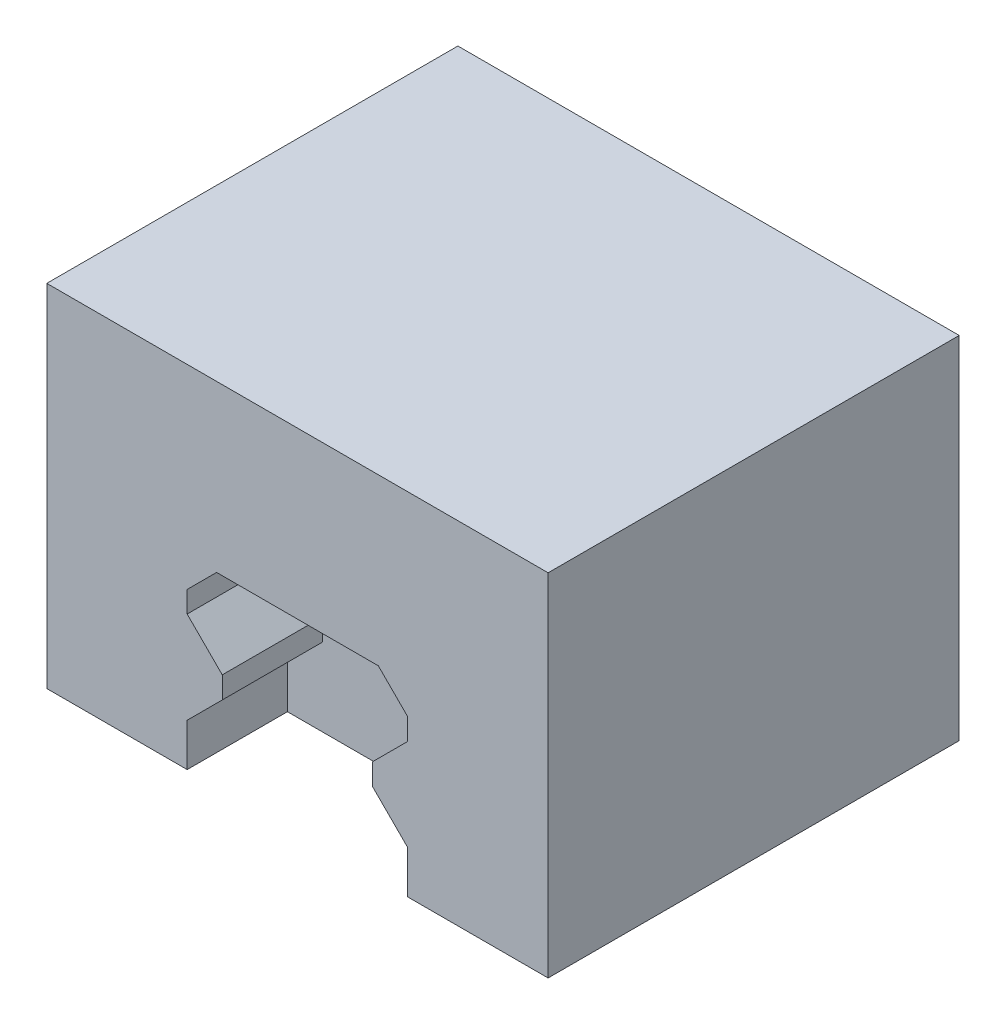
ISO-10303-21;
HEADER;
FILE_DESCRIPTION(('STEP AP214'),'2;1');
FILE_NAME('part.step','',(''),(''),'','','');
FILE_SCHEMA(('AUTOMOTIVE_DESIGN { 1 0 10303 214 1 1 1 1 }'));
ENDSEC;
DATA;
#1=APPLICATION_CONTEXT('core data for automotive mechanical design processes');
#2=APPLICATION_PROTOCOL_DEFINITION('international standard','automotive_design',2000,#1);
#3=PRODUCT_CONTEXT('',#1,'mechanical');
#4=PRODUCT('Part','Part','',(#3));
#5=PRODUCT_RELATED_PRODUCT_CATEGORY('part','',(#4));
#6=PRODUCT_DEFINITION_FORMATION('','',#4);
#7=PRODUCT_DEFINITION_CONTEXT('part definition',#1,'design');
#8=PRODUCT_DEFINITION('design','',#6,#7);
#9=PRODUCT_DEFINITION_SHAPE('','',#8);
#10=(LENGTH_UNIT() NAMED_UNIT(*) SI_UNIT(.MILLI.,.METRE.));
#11=(NAMED_UNIT(*) PLANE_ANGLE_UNIT() SI_UNIT($,.RADIAN.));
#12=(NAMED_UNIT(*) SI_UNIT($,.STERADIAN.) SOLID_ANGLE_UNIT());
#13=UNCERTAINTY_MEASURE_WITH_UNIT(LENGTH_MEASURE(1.E-05),#10,'distance_accuracy_value','');
#14=(GEOMETRIC_REPRESENTATION_CONTEXT(3) GLOBAL_UNCERTAINTY_ASSIGNED_CONTEXT((#13)) GLOBAL_UNIT_ASSIGNED_CONTEXT((#10,
#11,#12)) REPRESENTATION_CONTEXT('',''));
#15=CARTESIAN_POINT('',(0.,0.,0.));
#16=DIRECTION('',(0.,0.,1.));
#17=DIRECTION('',(1.,0.,0.));
#18=AXIS2_PLACEMENT_3D('',#15,#16,#17);
#19=CARTESIAN_POINT('',(-25.,-14.5,-31.));
#20=DIRECTION('',(0.,-1.,0.));
#21=DIRECTION('',(1.,0.,0.));
#22=AXIS2_PLACEMENT_3D('',#19,#20,#21);
#23=PLANE('',#22);
#24=DIRECTION('',(0.,0.,-1.));
#25=VECTOR('',#24,1.);
#26=CARTESIAN_POINT('',(-11.,-14.5,-31.));
#27=LINE('',#26,#25);
#28=CARTESIAN_POINT('',(-11.,-14.5,10.));
#29=VERTEX_POINT('',#28);
#30=CARTESIAN_POINT('',(-11.,-14.5,0.));
#31=VERTEX_POINT('',#30);
#32=EDGE_CURVE('E285',#29,#31,#27,.T.);
#33=ORIENTED_EDGE('',*,*,#32,.F.);
#34=DIRECTION('',(1.,0.,0.));
#35=VECTOR('',#34,1.);
#36=CARTESIAN_POINT('',(-25.,-14.5,10.));
#37=LINE('',#36,#35);
#38=CARTESIAN_POINT('',(-25.,-14.5,10.));
#39=VERTEX_POINT('',#38);
#40=EDGE_CURVE('E330',#39,#29,#37,.T.);
#41=ORIENTED_EDGE('',*,*,#40,.F.);
#42=DIRECTION('',(0.,0.,1.));
#43=VECTOR('',#42,1.);
#44=CARTESIAN_POINT('',(-25.,-14.5,-31.));
#45=LINE('',#44,#43);
#46=CARTESIAN_POINT('',(-25.,-14.5,-31.));
#47=VERTEX_POINT('',#46);
#48=EDGE_CURVE('E47',#47,#39,#45,.T.);
#49=ORIENTED_EDGE('',*,*,#48,.F.);
#50=DIRECTION('',(1.,0.,0.));
#51=VECTOR('',#50,1.);
#52=CARTESIAN_POINT('',(-25.,-14.5,-31.));
#53=LINE('',#52,#51);
#54=CARTESIAN_POINT('',(25.,-14.5,-31.));
#55=VERTEX_POINT('',#54);
#56=EDGE_CURVE('E345',#47,#55,#53,.T.);
#57=ORIENTED_EDGE('',*,*,#56,.T.);
#58=DIRECTION('',(0.,0.,1.));
#59=VECTOR('',#58,1.);
#60=CARTESIAN_POINT('',(25.,-14.5,-31.));
#61=LINE('',#60,#59);
#62=CARTESIAN_POINT('',(25.,-14.5,10.));
#63=VERTEX_POINT('',#62);
#64=EDGE_CURVE('E356',#55,#63,#61,.T.);
#65=ORIENTED_EDGE('',*,*,#64,.T.);
#66=CARTESIAN_POINT('',(11.,-14.5,10.));
#67=VERTEX_POINT('',#66);
#68=EDGE_CURVE('E329',#67,#63,#37,.T.);
#69=ORIENTED_EDGE('',*,*,#68,.F.);
#70=DIRECTION('',(0.,0.,1.));
#71=VECTOR('',#70,1.);
#72=CARTESIAN_POINT('',(11.,-14.5,-31.));
#73=LINE('',#72,#71);
#74=CARTESIAN_POINT('',(11.,-14.5,0.));
#75=VERTEX_POINT('',#74);
#76=EDGE_CURVE('E319',#75,#67,#73,.T.);
#77=ORIENTED_EDGE('',*,*,#76,.F.);
#78=DIRECTION('',(1.,0.,0.));
#79=VECTOR('',#78,1.);
#80=CARTESIAN_POINT('',(-10.,-14.5,0.));
#81=LINE('',#80,#79);
#82=EDGE_CURVE('E322',#31,#75,#81,.T.);
#83=ORIENTED_EDGE('',*,*,#82,.F.);
#84=EDGE_LOOP('',(#33,#41,#49,#57,#65,#69,#77,#83));
#85=FACE_BOUND('',#84,.T.);
#86=ADVANCED_FACE('F43',(#85),#23,.T.);
#87=CARTESIAN_POINT('',(0.,0.,10.));
#88=DIRECTION('',(0.,0.,1.));
#89=DIRECTION('',(1.,0.,0.));
#90=AXIS2_PLACEMENT_3D('',#87,#88,#89);
#91=PLANE('',#90);
#92=DIRECTION('',(0.,1.,0.));
#93=VECTOR('',#92,1.);
#94=CARTESIAN_POINT('',(11.,-15.5,10.));
#95=LINE('',#94,#93);
#96=CARTESIAN_POINT('',(11.,-10.2357864376269,10.));
#97=VERTEX_POINT('',#96);
#98=EDGE_CURVE('E248',#67,#97,#95,.T.);
#99=ORIENTED_EDGE('',*,*,#98,.F.);
#100=ORIENTED_EDGE('',*,*,#68,.T.);
#101=DIRECTION('',(0.,1.,0.));
#102=VECTOR('',#101,1.);
#103=CARTESIAN_POINT('',(25.,20.5,10.));
#104=LINE('',#103,#102);
#105=CARTESIAN_POINT('',(25.,20.5,10.));
#106=VERTEX_POINT('',#105);
#107=EDGE_CURVE('E334',#63,#106,#104,.T.);
#108=ORIENTED_EDGE('',*,*,#107,.T.);
#109=DIRECTION('',(-1.,0.,0.));
#110=VECTOR('',#109,1.);
#111=CARTESIAN_POINT('',(-25.,20.5,10.));
#112=LINE('',#111,#110);
#113=CARTESIAN_POINT('',(-25.,20.5,10.));
#114=VERTEX_POINT('',#113);
#115=EDGE_CURVE('E338',#106,#114,#112,.T.);
#116=ORIENTED_EDGE('',*,*,#115,.T.);
#117=DIRECTION('',(0.,-1.,0.));
#118=VECTOR('',#117,1.);
#119=CARTESIAN_POINT('',(-25.,20.5,10.));
#120=LINE('',#119,#118);
#121=EDGE_CURVE('E325',#114,#39,#120,.T.);
#122=ORIENTED_EDGE('',*,*,#121,.T.);
#123=ORIENTED_EDGE('',*,*,#40,.T.);
#124=DIRECTION('',(0.,-1.,0.));
#125=VECTOR('',#124,1.);
#126=CARTESIAN_POINT('',(-11.,-10.2357864376269,10.));
#127=LINE('',#126,#125);
#128=CARTESIAN_POINT('',(-11.,-10.2357864376269,10.));
#129=VERTEX_POINT('',#128);
#130=EDGE_CURVE('E245',#129,#29,#127,.T.);
#131=ORIENTED_EDGE('',*,*,#130,.F.);
#132=DIRECTION('',(-0.707106781186548,-0.707106781186547,0.));
#133=VECTOR('',#132,1.);
#134=CARTESIAN_POINT('',(-7.5,-6.7357864376269,10.));
#135=LINE('',#134,#133);
#136=CARTESIAN_POINT('',(-7.5,-6.7357864376269,10.));
#137=VERTEX_POINT('',#136);
#138=EDGE_CURVE('E241',#137,#129,#135,.T.);
#139=ORIENTED_EDGE('',*,*,#138,.F.);
#140=DIRECTION('',(0.,-1.,0.));
#141=VECTOR('',#140,1.);
#142=CARTESIAN_POINT('',(-7.5,-4.5642135623731,10.));
#143=LINE('',#142,#141);
#144=CARTESIAN_POINT('',(-7.5,-4.5642135623731,10.));
#145=VERTEX_POINT('',#144);
#146=EDGE_CURVE('E238',#145,#137,#143,.T.);
#147=ORIENTED_EDGE('',*,*,#146,.F.);
#148=DIRECTION('',(0.707106781186549,-0.707106781186546,0.));
#149=VECTOR('',#148,1.);
#150=CARTESIAN_POINT('',(-9.972086609225,-2.0921269531481,10.));
#151=LINE('',#150,#149);
#152=CARTESIAN_POINT('',(-11.,-1.06421356237309,10.));
#153=VERTEX_POINT('',#152);
#154=EDGE_CURVE('E176',#153,#145,#151,.T.);
#155=ORIENTED_EDGE('',*,*,#154,.F.);
#156=DIRECTION('',(0.,-1.,0.));
#157=VECTOR('',#156,1.);
#158=CARTESIAN_POINT('',(-11.,1.06421356237309,10.));
#159=LINE('',#158,#157);
#160=CARTESIAN_POINT('',(-11.,1.06421356237309,10.));
#161=VERTEX_POINT('',#160);
#162=EDGE_CURVE('E200',#161,#153,#159,.T.);
#163=ORIENTED_EDGE('',*,*,#162,.F.);
#164=DIRECTION('',(-0.707106781186545,-0.70710678118655,0.));
#165=VECTOR('',#164,1.);
#166=CARTESIAN_POINT('',(-9.972086609225,2.0921269531481,10.));
#167=LINE('',#166,#165);
#168=CARTESIAN_POINT('',(-8.06421356237309,4.,10.));
#169=VERTEX_POINT('',#168);
#170=EDGE_CURVE('E275',#169,#161,#167,.T.);
#171=ORIENTED_EDGE('',*,*,#170,.F.);
#172=DIRECTION('',(-1.,0.,0.));
#173=VECTOR('',#172,1.);
#174=CARTESIAN_POINT('',(8.06421356237309,4.,10.));
#175=LINE('',#174,#173);
#176=CARTESIAN_POINT('',(8.06421356237309,4.,10.));
#177=VERTEX_POINT('',#176);
#178=EDGE_CURVE('E271',#177,#169,#175,.T.);
#179=ORIENTED_EDGE('',*,*,#178,.F.);
#180=DIRECTION('',(-0.707106781186547,0.707106781186547,0.));
#181=VECTOR('',#180,1.);
#182=CARTESIAN_POINT('',(9.0921269531481,2.972086609225,10.));
#183=LINE('',#182,#181);
#184=CARTESIAN_POINT('',(11.,1.0642135623731,10.));
#185=VERTEX_POINT('',#184);
#186=EDGE_CURVE('E267',#185,#177,#183,.T.);
#187=ORIENTED_EDGE('',*,*,#186,.F.);
#188=DIRECTION('',(0.,1.,0.));
#189=VECTOR('',#188,1.);
#190=CARTESIAN_POINT('',(11.,-1.06421356237309,10.));
#191=LINE('',#190,#189);
#192=CARTESIAN_POINT('',(11.,-1.06421356237309,10.));
#193=VERTEX_POINT('',#192);
#194=EDGE_CURVE('E263',#193,#185,#191,.T.);
#195=ORIENTED_EDGE('',*,*,#194,.F.);
#196=DIRECTION('',(0.707106781186545,0.70710678118655,0.));
#197=VECTOR('',#196,1.);
#198=CARTESIAN_POINT('',(9.972086609225,-2.0921269531481,10.));
#199=LINE('',#198,#197);
#200=CARTESIAN_POINT('',(7.5,-4.56421356237309,10.));
#201=VERTEX_POINT('',#200);
#202=EDGE_CURVE('E259',#201,#193,#199,.T.);
#203=ORIENTED_EDGE('',*,*,#202,.F.);
#204=DIRECTION('',(0.,1.,0.));
#205=VECTOR('',#204,1.);
#206=CARTESIAN_POINT('',(7.5,-6.7357864376269,10.));
#207=LINE('',#206,#205);
#208=CARTESIAN_POINT('',(7.5,-6.7357864376269,10.));
#209=VERTEX_POINT('',#208);
#210=EDGE_CURVE('E255',#209,#201,#207,.T.);
#211=ORIENTED_EDGE('',*,*,#210,.F.);
#212=DIRECTION('',(-0.707106781186549,0.707106781186546,0.));
#213=VECTOR('',#212,1.);
#214=CARTESIAN_POINT('',(11.,-10.2357864376269,10.));
#215=LINE('',#214,#213);
#216=EDGE_CURVE('E251',#97,#209,#215,.T.);
#217=ORIENTED_EDGE('',*,*,#216,.F.);
#218=EDGE_LOOP('',(#99,#100,#108,#116,#122,#123,#131,#139,#147,#155,#163,#171,#179,#187,#195,
#203,#211,#217));
#219=FACE_BOUND('',#218,.T.);
#220=ADVANCED_FACE('F369',(#219),#91,.T.);
#221=CARTESIAN_POINT('',(-25.,20.5,-31.));
#222=DIRECTION('',(-1.,0.,0.));
#223=DIRECTION('',(0.,-1.,0.));
#224=AXIS2_PLACEMENT_3D('',#221,#222,#223);
#225=PLANE('',#224);
#226=ORIENTED_EDGE('',*,*,#48,.T.);
#227=ORIENTED_EDGE('',*,*,#121,.F.);
#228=DIRECTION('',(0.,0.,1.));
#229=VECTOR('',#228,1.);
#230=CARTESIAN_POINT('',(-25.,20.5,-31.));
#231=LINE('',#230,#229);
#232=CARTESIAN_POINT('',(-25.,20.5,-31.));
#233=VERTEX_POINT('',#232);
#234=EDGE_CURVE('E11',#233,#114,#231,.T.);
#235=ORIENTED_EDGE('',*,*,#234,.F.);
#236=DIRECTION('',(0.,-1.,0.));
#237=VECTOR('',#236,1.);
#238=CARTESIAN_POINT('',(-25.,20.5,-31.));
#239=LINE('',#238,#237);
#240=EDGE_CURVE('E342',#233,#47,#239,.T.);
#241=ORIENTED_EDGE('',*,*,#240,.T.);
#242=EDGE_LOOP('',(#226,#227,#235,#241));
#243=FACE_BOUND('',#242,.T.);
#244=ADVANCED_FACE('F45',(#243),#225,.T.);
#245=CARTESIAN_POINT('',(-25.,20.5,-31.));
#246=DIRECTION('',(0.,1.,0.));
#247=DIRECTION('',(-1.,0.,0.));
#248=AXIS2_PLACEMENT_3D('',#245,#246,#247);
#249=PLANE('',#248);
#250=ORIENTED_EDGE('',*,*,#234,.T.);
#251=ORIENTED_EDGE('',*,*,#115,.F.);
#252=DIRECTION('',(0.,0.,1.));
#253=VECTOR('',#252,1.);
#254=CARTESIAN_POINT('',(25.,20.5,-31.));
#255=LINE('',#254,#253);
#256=CARTESIAN_POINT('',(25.,20.5,-31.));
#257=VERTEX_POINT('',#256);
#258=EDGE_CURVE('E53',#257,#106,#255,.T.);
#259=ORIENTED_EDGE('',*,*,#258,.F.);
#260=DIRECTION('',(-1.,0.,0.));
#261=VECTOR('',#260,1.);
#262=CARTESIAN_POINT('',(-25.,20.5,-31.));
#263=LINE('',#262,#261);
#264=EDGE_CURVE('E352',#257,#233,#263,.T.);
#265=ORIENTED_EDGE('',*,*,#264,.T.);
#266=EDGE_LOOP('',(#250,#251,#259,#265));
#267=FACE_BOUND('',#266,.T.);
#268=ADVANCED_FACE('F370',(#267),#249,.T.);
#269=CARTESIAN_POINT('',(25.,20.5,-31.));
#270=DIRECTION('',(1.,0.,0.));
#271=DIRECTION('',(0.,1.,0.));
#272=AXIS2_PLACEMENT_3D('',#269,#270,#271);
#273=PLANE('',#272);
#274=ORIENTED_EDGE('',*,*,#258,.T.);
#275=ORIENTED_EDGE('',*,*,#107,.F.);
#276=ORIENTED_EDGE('',*,*,#64,.F.);
#277=DIRECTION('',(0.,1.,0.));
#278=VECTOR('',#277,1.);
#279=CARTESIAN_POINT('',(25.,20.5,-31.));
#280=LINE('',#279,#278);
#281=EDGE_CURVE('E349',#55,#257,#280,.T.);
#282=ORIENTED_EDGE('',*,*,#281,.T.);
#283=EDGE_LOOP('',(#274,#275,#276,#282));
#284=FACE_BOUND('',#283,.T.);
#285=ADVANCED_FACE('F376',(#284),#273,.T.);
#286=CARTESIAN_POINT('',(0.,0.,-31.));
#287=DIRECTION('',(0.,0.,1.));
#288=DIRECTION('',(1.,0.,0.));
#289=AXIS2_PLACEMENT_3D('',#286,#287,#288);
#290=PLANE('',#289);
#291=ORIENTED_EDGE('',*,*,#240,.F.);
#292=ORIENTED_EDGE('',*,*,#264,.F.);
#293=ORIENTED_EDGE('',*,*,#281,.F.);
#294=ORIENTED_EDGE('',*,*,#56,.F.);
#295=EDGE_LOOP('',(#291,#292,#293,#294));
#296=FACE_BOUND('',#295,.T.);
#297=ADVANCED_FACE('F374',(#296),#290,.F.);
#298=CARTESIAN_POINT('',(-9.64644660940673,-2.64644660940673,0.));
#299=DIRECTION('',(0.,0.,-1.));
#300=DIRECTION('',(-1.,0.,0.));
#301=AXIS2_PLACEMENT_3D('',#298,#299,#300);
#302=PLANE('',#301);
#303=DIRECTION('',(0.,-1.,0.));
#304=VECTOR('',#303,1.);
#305=CARTESIAN_POINT('',(-11.,-10.2357864376269,0.));
#306=LINE('',#305,#304);
#307=CARTESIAN_POINT('',(-11.,-10.2357864376269,0.));
#308=VERTEX_POINT('',#307);
#309=EDGE_CURVE('E205',#308,#31,#306,.T.);
#310=ORIENTED_EDGE('',*,*,#309,.T.);
#311=ORIENTED_EDGE('',*,*,#82,.T.);
#312=DIRECTION('',(0.,1.,0.));
#313=VECTOR('',#312,1.);
#314=CARTESIAN_POINT('',(11.,-15.5,0.));
#315=LINE('',#314,#313);
#316=CARTESIAN_POINT('',(11.,-10.2357864376269,0.));
#317=VERTEX_POINT('',#316);
#318=EDGE_CURVE('E208',#75,#317,#315,.T.);
#319=ORIENTED_EDGE('',*,*,#318,.T.);
#320=DIRECTION('',(-0.707106781186549,0.707106781186546,0.));
#321=VECTOR('',#320,1.);
#322=CARTESIAN_POINT('',(11.,-10.2357864376269,0.));
#323=LINE('',#322,#321);
#324=CARTESIAN_POINT('',(7.5,-6.7357864376269,0.));
#325=VERTEX_POINT('',#324);
#326=EDGE_CURVE('E211',#317,#325,#323,.T.);
#327=ORIENTED_EDGE('',*,*,#326,.T.);
#328=DIRECTION('',(0.,1.,0.));
#329=VECTOR('',#328,1.);
#330=CARTESIAN_POINT('',(7.5,-6.7357864376269,0.));
#331=LINE('',#330,#329);
#332=CARTESIAN_POINT('',(7.5,-4.56421356237309,0.));
#333=VERTEX_POINT('',#332);
#334=EDGE_CURVE('E215',#325,#333,#331,.T.);
#335=ORIENTED_EDGE('',*,*,#334,.T.);
#336=DIRECTION('',(0.707106781186548,0.707106781186547,0.));
#337=VECTOR('',#336,1.);
#338=CARTESIAN_POINT('',(7.5,-4.56421356237309,0.));
#339=LINE('',#338,#337);
#340=CARTESIAN_POINT('',(11.,-1.06421356237309,0.));
#341=VERTEX_POINT('',#340);
#342=EDGE_CURVE('E219',#333,#341,#339,.T.);
#343=ORIENTED_EDGE('',*,*,#342,.T.);
#344=DIRECTION('',(0.,1.,0.));
#345=VECTOR('',#344,1.);
#346=CARTESIAN_POINT('',(11.,-1.06421356237309,0.));
#347=LINE('',#346,#345);
#348=CARTESIAN_POINT('',(11.,1.0642135623731,0.));
#349=VERTEX_POINT('',#348);
#350=EDGE_CURVE('E222',#341,#349,#347,.T.);
#351=ORIENTED_EDGE('',*,*,#350,.T.);
#352=DIRECTION('',(-0.707106781186545,0.707106781186551,0.));
#353=VECTOR('',#352,1.);
#354=CARTESIAN_POINT('',(11.,1.0642135623731,0.));
#355=LINE('',#354,#353);
#356=CARTESIAN_POINT('',(8.06421356237309,4.,0.));
#357=VERTEX_POINT('',#356);
#358=EDGE_CURVE('E226',#349,#357,#355,.T.);
#359=ORIENTED_EDGE('',*,*,#358,.T.);
#360=DIRECTION('',(-1.,0.,0.));
#361=VECTOR('',#360,1.);
#362=CARTESIAN_POINT('',(8.06421356237309,4.,0.));
#363=LINE('',#362,#361);
#364=CARTESIAN_POINT('',(-8.06421356237309,4.,0.));
#365=VERTEX_POINT('',#364);
#366=EDGE_CURVE('E229',#357,#365,#363,.T.);
#367=ORIENTED_EDGE('',*,*,#366,.T.);
#368=DIRECTION('',(-0.707106781186548,-0.707106781186547,0.));
#369=VECTOR('',#368,1.);
#370=CARTESIAN_POINT('',(-8.06421356237309,4.,0.));
#371=LINE('',#370,#369);
#372=CARTESIAN_POINT('',(-11.,1.06421356237309,0.));
#373=VERTEX_POINT('',#372);
#374=EDGE_CURVE('E233',#365,#373,#371,.T.);
#375=ORIENTED_EDGE('',*,*,#374,.T.);
#376=DIRECTION('',(0.,-1.,0.));
#377=VECTOR('',#376,1.);
#378=CARTESIAN_POINT('',(-11.,1.06421356237309,0.));
#379=LINE('',#378,#377);
#380=CARTESIAN_POINT('',(-11.,-1.06421356237309,0.));
#381=VERTEX_POINT('',#380);
#382=EDGE_CURVE('E182',#373,#381,#379,.T.);
#383=ORIENTED_EDGE('',*,*,#382,.T.);
#384=DIRECTION('',(0.707106781186548,-0.707106781186547,0.));
#385=VECTOR('',#384,1.);
#386=CARTESIAN_POINT('',(-9.0921269531481,-2.97208660922499,0.));
#387=LINE('',#386,#385);
#388=CARTESIAN_POINT('',(-7.5,-4.5642135623731,0.));
#389=VERTEX_POINT('',#388);
#390=EDGE_CURVE('E173',#381,#389,#387,.T.);
#391=ORIENTED_EDGE('',*,*,#390,.T.);
#392=DIRECTION('',(0.,-1.,0.));
#393=VECTOR('',#392,1.);
#394=CARTESIAN_POINT('',(-7.5,-4.5642135623731,0.));
#395=LINE('',#394,#393);
#396=CARTESIAN_POINT('',(-7.5,-6.7357864376269,0.));
#397=VERTEX_POINT('',#396);
#398=EDGE_CURVE('E185',#389,#397,#395,.T.);
#399=ORIENTED_EDGE('',*,*,#398,.T.);
#400=DIRECTION('',(-0.707106781186548,-0.707106781186547,0.));
#401=VECTOR('',#400,1.);
#402=CARTESIAN_POINT('',(-7.5,-6.7357864376269,0.));
#403=LINE('',#402,#401);
#404=EDGE_CURVE('E191',#397,#308,#403,.T.);
#405=ORIENTED_EDGE('',*,*,#404,.T.);
#406=EDGE_LOOP('',(#310,#311,#319,#327,#335,#343,#351,#359,#367,#375,#383,#391,#399,#405));
#407=FACE_BOUND('',#406,.T.);
#408=ADVANCED_FACE('F195',(#407),#302,.F.);
#409=CARTESIAN_POINT('',(-9.972086609225,-2.0921269531481,0.));
#410=DIRECTION('',(-0.707106781186546,-0.707106781186549,0.));
#411=DIRECTION('',(0.707106781186549,-0.707106781186546,0.));
#412=AXIS2_PLACEMENT_3D('',#409,#410,#411);
#413=PLANE('',#412);
#414=ORIENTED_EDGE('',*,*,#154,.T.);
#415=DIRECTION('',(0.,0.,1.));
#416=VECTOR('',#415,1.);
#417=CARTESIAN_POINT('',(-7.5,-4.5642135623731,0.));
#418=LINE('',#417,#416);
#419=EDGE_CURVE('E169',#389,#145,#418,.T.);
#420=ORIENTED_EDGE('',*,*,#419,.F.);
#421=ORIENTED_EDGE('',*,*,#390,.F.);
#422=DIRECTION('',(0.,0.,1.));
#423=VECTOR('',#422,1.);
#424=CARTESIAN_POINT('',(-11.,-1.06421356237309,0.));
#425=LINE('',#424,#423);
#426=EDGE_CURVE('E282',#381,#153,#425,.T.);
#427=ORIENTED_EDGE('',*,*,#426,.T.);
#428=EDGE_LOOP('',(#414,#420,#421,#427));
#429=FACE_BOUND('',#428,.T.);
#430=ADVANCED_FACE('F171',(#429),#413,.F.);
#431=CARTESIAN_POINT('',(-11.,1.06421356237309,0.));
#432=DIRECTION('',(-1.,0.,0.));
#433=DIRECTION('',(0.,0.,1.));
#434=AXIS2_PLACEMENT_3D('',#431,#432,#433);
#435=PLANE('',#434);
#436=ORIENTED_EDGE('',*,*,#162,.T.);
#437=ORIENTED_EDGE('',*,*,#426,.F.);
#438=ORIENTED_EDGE('',*,*,#382,.F.);
#439=DIRECTION('',(0.,0.,1.));
#440=VECTOR('',#439,1.);
#441=CARTESIAN_POINT('',(-11.,1.06421356237309,0.));
#442=LINE('',#441,#440);
#443=EDGE_CURVE('E286',#373,#161,#442,.T.);
#444=ORIENTED_EDGE('',*,*,#443,.T.);
#445=EDGE_LOOP('',(#436,#437,#438,#444));
#446=FACE_BOUND('',#445,.T.);
#447=ADVANCED_FACE('F437',(#446),#435,.F.);
#448=CARTESIAN_POINT('',(-9.972086609225,2.0921269531481,0.));
#449=DIRECTION('',(-0.70710678118655,0.707106781186545,0.));
#450=DIRECTION('',(-0.707106781186545,-0.70710678118655,0.));
#451=AXIS2_PLACEMENT_3D('',#448,#449,#450);
#452=PLANE('',#451);
#453=ORIENTED_EDGE('',*,*,#170,.T.);
#454=ORIENTED_EDGE('',*,*,#443,.F.);
#455=ORIENTED_EDGE('',*,*,#374,.F.);
#456=DIRECTION('',(0.,0.,1.));
#457=VECTOR('',#456,1.);
#458=CARTESIAN_POINT('',(-8.06421356237309,4.,0.));
#459=LINE('',#458,#457);
#460=EDGE_CURVE('E289',#365,#169,#459,.T.);
#461=ORIENTED_EDGE('',*,*,#460,.T.);
#462=EDGE_LOOP('',(#453,#454,#455,#461));
#463=FACE_BOUND('',#462,.T.);
#464=ADVANCED_FACE('F433',(#463),#452,.F.);
#465=CARTESIAN_POINT('',(8.06421356237309,4.,0.));
#466=DIRECTION('',(0.,1.,0.));
#467=DIRECTION('',(-1.,0.,0.));
#468=AXIS2_PLACEMENT_3D('',#465,#466,#467);
#469=PLANE('',#468);
#470=ORIENTED_EDGE('',*,*,#178,.T.);
#471=ORIENTED_EDGE('',*,*,#460,.F.);
#472=ORIENTED_EDGE('',*,*,#366,.F.);
#473=DIRECTION('',(0.,0.,1.));
#474=VECTOR('',#473,1.);
#475=CARTESIAN_POINT('',(8.06421356237309,4.,0.));
#476=LINE('',#475,#474);
#477=EDGE_CURVE('E292',#357,#177,#476,.T.);
#478=ORIENTED_EDGE('',*,*,#477,.T.);
#479=EDGE_LOOP('',(#470,#471,#472,#478));
#480=FACE_BOUND('',#479,.T.);
#481=ADVANCED_FACE('F429',(#480),#469,.F.);
#482=CARTESIAN_POINT('',(9.0921269531481,2.972086609225,0.));
#483=DIRECTION('',(0.707106781186548,0.707106781186548,0.));
#484=DIRECTION('',(-0.707106781186548,0.707106781186548,0.));
#485=AXIS2_PLACEMENT_3D('',#482,#483,#484);
#486=PLANE('',#485);
#487=ORIENTED_EDGE('',*,*,#186,.T.);
#488=ORIENTED_EDGE('',*,*,#477,.F.);
#489=ORIENTED_EDGE('',*,*,#358,.F.);
#490=DIRECTION('',(0.,0.,1.));
#491=VECTOR('',#490,1.);
#492=CARTESIAN_POINT('',(11.,1.0642135623731,0.));
#493=LINE('',#492,#491);
#494=EDGE_CURVE('E295',#349,#185,#493,.T.);
#495=ORIENTED_EDGE('',*,*,#494,.T.);
#496=EDGE_LOOP('',(#487,#488,#489,#495));
#497=FACE_BOUND('',#496,.T.);
#498=ADVANCED_FACE('F425',(#497),#486,.F.);
#499=CARTESIAN_POINT('',(11.,-1.06421356237309,0.));
#500=DIRECTION('',(1.,0.,0.));
#501=DIRECTION('',(0.,0.,-1.));
#502=AXIS2_PLACEMENT_3D('',#499,#500,#501);
#503=PLANE('',#502);
#504=ORIENTED_EDGE('',*,*,#194,.T.);
#505=ORIENTED_EDGE('',*,*,#494,.F.);
#506=ORIENTED_EDGE('',*,*,#350,.F.);
#507=DIRECTION('',(0.,0.,1.));
#508=VECTOR('',#507,1.);
#509=CARTESIAN_POINT('',(11.,-1.06421356237309,0.));
#510=LINE('',#509,#508);
#511=EDGE_CURVE('E298',#341,#193,#510,.T.);
#512=ORIENTED_EDGE('',*,*,#511,.T.);
#513=EDGE_LOOP('',(#504,#505,#506,#512));
#514=FACE_BOUND('',#513,.T.);
#515=ADVANCED_FACE('F421',(#514),#503,.F.);
#516=CARTESIAN_POINT('',(9.972086609225,-2.0921269531481,0.));
#517=DIRECTION('',(0.70710678118655,-0.707106781186545,0.));
#518=DIRECTION('',(0.707106781186545,0.70710678118655,0.));
#519=AXIS2_PLACEMENT_3D('',#516,#517,#518);
#520=PLANE('',#519);
#521=ORIENTED_EDGE('',*,*,#202,.T.);
#522=ORIENTED_EDGE('',*,*,#511,.F.);
#523=ORIENTED_EDGE('',*,*,#342,.F.);
#524=DIRECTION('',(0.,0.,1.));
#525=VECTOR('',#524,1.);
#526=CARTESIAN_POINT('',(7.5,-4.56421356237309,0.));
#527=LINE('',#526,#525);
#528=EDGE_CURVE('E301',#333,#201,#527,.T.);
#529=ORIENTED_EDGE('',*,*,#528,.T.);
#530=EDGE_LOOP('',(#521,#522,#523,#529));
#531=FACE_BOUND('',#530,.T.);
#532=ADVANCED_FACE('F417',(#531),#520,.F.);
#533=CARTESIAN_POINT('',(7.5,-6.7357864376269,0.));
#534=DIRECTION('',(1.,0.,0.));
#535=DIRECTION('',(0.,0.,-1.));
#536=AXIS2_PLACEMENT_3D('',#533,#534,#535);
#537=PLANE('',#536);
#538=ORIENTED_EDGE('',*,*,#210,.T.);
#539=ORIENTED_EDGE('',*,*,#528,.F.);
#540=ORIENTED_EDGE('',*,*,#334,.F.);
#541=DIRECTION('',(0.,0.,1.));
#542=VECTOR('',#541,1.);
#543=CARTESIAN_POINT('',(7.5,-6.7357864376269,0.));
#544=LINE('',#543,#542);
#545=EDGE_CURVE('E304',#325,#209,#544,.T.);
#546=ORIENTED_EDGE('',*,*,#545,.T.);
#547=EDGE_LOOP('',(#538,#539,#540,#546));
#548=FACE_BOUND('',#547,.T.);
#549=ADVANCED_FACE('F413',(#548),#537,.F.);
#550=CARTESIAN_POINT('',(11.,-10.2357864376269,0.));
#551=DIRECTION('',(0.707106781186546,0.707106781186549,0.));
#552=DIRECTION('',(-0.707106781186549,0.707106781186546,0.));
#553=AXIS2_PLACEMENT_3D('',#550,#551,#552);
#554=PLANE('',#553);
#555=ORIENTED_EDGE('',*,*,#216,.T.);
#556=ORIENTED_EDGE('',*,*,#545,.F.);
#557=ORIENTED_EDGE('',*,*,#326,.F.);
#558=DIRECTION('',(0.,0.,1.));
#559=VECTOR('',#558,1.);
#560=CARTESIAN_POINT('',(11.,-10.2357864376269,0.));
#561=LINE('',#560,#559);
#562=EDGE_CURVE('E307',#317,#97,#561,.T.);
#563=ORIENTED_EDGE('',*,*,#562,.T.);
#564=EDGE_LOOP('',(#555,#556,#557,#563));
#565=FACE_BOUND('',#564,.T.);
#566=ADVANCED_FACE('F409',(#565),#554,.F.);
#567=CARTESIAN_POINT('',(11.,-15.5,0.));
#568=DIRECTION('',(1.,0.,0.));
#569=DIRECTION('',(0.,1.,0.));
#570=AXIS2_PLACEMENT_3D('',#567,#568,#569);
#571=PLANE('',#570);
#572=ORIENTED_EDGE('',*,*,#76,.T.);
#573=ORIENTED_EDGE('',*,*,#98,.T.);
#574=ORIENTED_EDGE('',*,*,#562,.F.);
#575=ORIENTED_EDGE('',*,*,#318,.F.);
#576=EDGE_LOOP('',(#572,#573,#574,#575));
#577=FACE_BOUND('',#576,.T.);
#578=ADVANCED_FACE('F405',(#577),#571,.F.);
#579=CARTESIAN_POINT('',(-11.,-10.2357864376269,0.));
#580=DIRECTION('',(-1.,0.,0.));
#581=DIRECTION('',(0.,-1.,0.));
#582=AXIS2_PLACEMENT_3D('',#579,#580,#581);
#583=PLANE('',#582);
#584=ORIENTED_EDGE('',*,*,#32,.T.);
#585=ORIENTED_EDGE('',*,*,#309,.F.);
#586=DIRECTION('',(0.,0.,1.));
#587=VECTOR('',#586,1.);
#588=CARTESIAN_POINT('',(-11.,-10.2357864376269,0.));
#589=LINE('',#588,#587);
#590=EDGE_CURVE('E311',#308,#129,#589,.T.);
#591=ORIENTED_EDGE('',*,*,#590,.T.);
#592=ORIENTED_EDGE('',*,*,#130,.T.);
#593=EDGE_LOOP('',(#584,#585,#591,#592));
#594=FACE_BOUND('',#593,.T.);
#595=ADVANCED_FACE('F401',(#594),#583,.F.);
#596=CARTESIAN_POINT('',(-7.5,-6.7357864376269,0.));
#597=DIRECTION('',(-0.707106781186547,0.707106781186548,0.));
#598=DIRECTION('',(-0.707106781186548,-0.707106781186547,0.));
#599=AXIS2_PLACEMENT_3D('',#596,#597,#598);
#600=PLANE('',#599);
#601=ORIENTED_EDGE('',*,*,#138,.T.);
#602=ORIENTED_EDGE('',*,*,#590,.F.);
#603=ORIENTED_EDGE('',*,*,#404,.F.);
#604=DIRECTION('',(0.,0.,1.));
#605=VECTOR('',#604,1.);
#606=CARTESIAN_POINT('',(-7.5,-6.7357864376269,0.));
#607=LINE('',#606,#605);
#608=EDGE_CURVE('E181',#397,#137,#607,.T.);
#609=ORIENTED_EDGE('',*,*,#608,.T.);
#610=EDGE_LOOP('',(#601,#602,#603,#609));
#611=FACE_BOUND('',#610,.T.);
#612=ADVANCED_FACE('F398',(#611),#600,.F.);
#613=CARTESIAN_POINT('',(-7.5,-4.5642135623731,0.));
#614=DIRECTION('',(-1.,0.,0.));
#615=DIRECTION('',(0.,-1.,0.));
#616=AXIS2_PLACEMENT_3D('',#613,#614,#615);
#617=PLANE('',#616);
#618=ORIENTED_EDGE('',*,*,#146,.T.);
#619=ORIENTED_EDGE('',*,*,#608,.F.);
#620=ORIENTED_EDGE('',*,*,#398,.F.);
#621=ORIENTED_EDGE('',*,*,#419,.T.);
#622=EDGE_LOOP('',(#618,#619,#620,#621));
#623=FACE_BOUND('',#622,.T.);
#624=ADVANCED_FACE('F186',(#623),#617,.F.);
#625=CLOSED_SHELL('',(#86,#220,#244,#268,#285,#297,#408,#430,#447,#464,#481,#498,#515,#532,#549,
#566,#578,#595,#612,#624));
#626=MANIFOLD_SOLID_BREP('B2',#625);
#627=ADVANCED_BREP_SHAPE_REPRESENTATION('',(#18,#626),#14);
#628=SHAPE_DEFINITION_REPRESENTATION(#9,#627);
ENDSEC;
END-ISO-10303-21;
